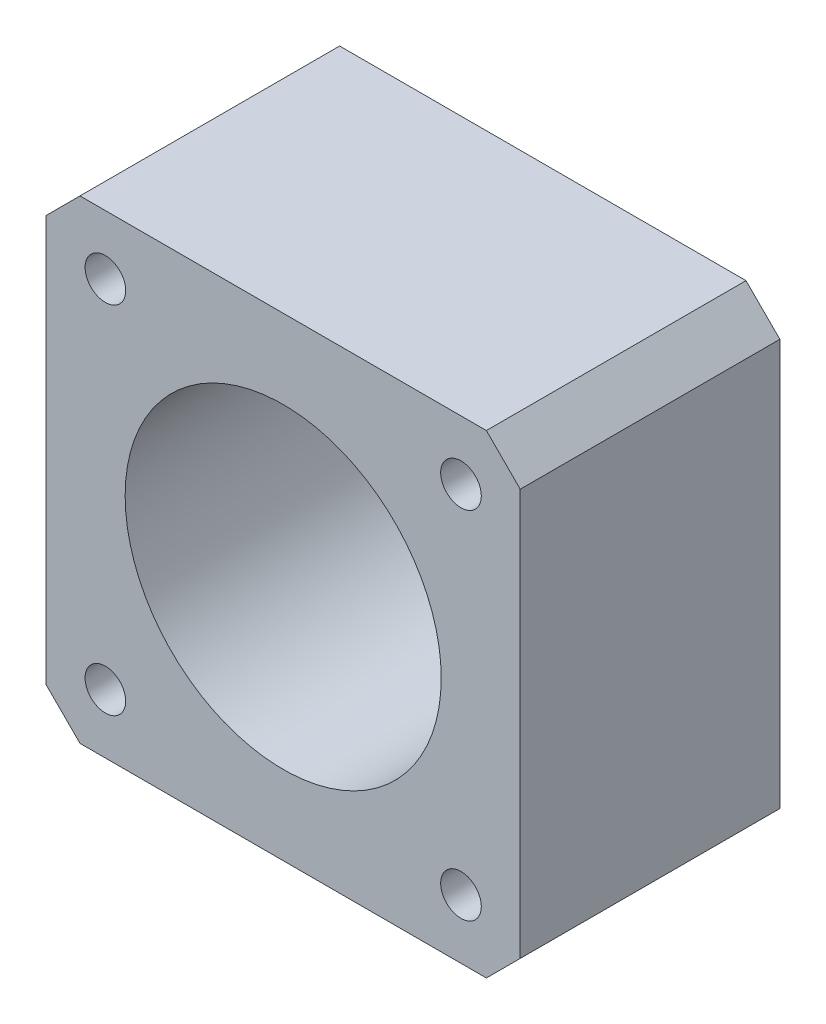
ISO-10303-21;
HEADER;
FILE_DESCRIPTION(('STEP AP214'),'2;1');
FILE_NAME('part.step','',(''),(''),'','','');
FILE_SCHEMA(('AUTOMOTIVE_DESIGN { 1 0 10303 214 1 1 1 1 }'));
ENDSEC;
DATA;
#1=APPLICATION_CONTEXT('core data for automotive mechanical design processes');
#2=APPLICATION_PROTOCOL_DEFINITION('international standard','automotive_design',2000,#1);
#3=PRODUCT_CONTEXT('',#1,'mechanical');
#4=PRODUCT('Part','Part','',(#3));
#5=PRODUCT_RELATED_PRODUCT_CATEGORY('part','',(#4));
#6=PRODUCT_DEFINITION_FORMATION('','',#4);
#7=PRODUCT_DEFINITION_CONTEXT('part definition',#1,'design');
#8=PRODUCT_DEFINITION('design','',#6,#7);
#9=PRODUCT_DEFINITION_SHAPE('','',#8);
#10=(LENGTH_UNIT() NAMED_UNIT(*) SI_UNIT(.MILLI.,.METRE.));
#11=(NAMED_UNIT(*) PLANE_ANGLE_UNIT() SI_UNIT($,.RADIAN.));
#12=(NAMED_UNIT(*) SI_UNIT($,.STERADIAN.) SOLID_ANGLE_UNIT());
#13=UNCERTAINTY_MEASURE_WITH_UNIT(LENGTH_MEASURE(1.E-05),#10,'distance_accuracy_value','');
#14=(GEOMETRIC_REPRESENTATION_CONTEXT(3) GLOBAL_UNCERTAINTY_ASSIGNED_CONTEXT((#13)) GLOBAL_UNIT_ASSIGNED_CONTEXT((#10,
#11,#12)) REPRESENTATION_CONTEXT('',''));
#15=CARTESIAN_POINT('',(0.,0.,0.));
#16=DIRECTION('',(0.,0.,1.));
#17=DIRECTION('',(1.,0.,0.));
#18=AXIS2_PLACEMENT_3D('',#15,#16,#17);
#19=CARTESIAN_POINT('',(21.,21.,23.));
#20=DIRECTION('',(-1.,0.,0.));
#21=DIRECTION('',(0.,-1.,0.));
#22=AXIS2_PLACEMENT_3D('',#19,#20,#21);
#23=PLANE('',#22);
#24=DIRECTION('',(0.,1.,0.));
#25=VECTOR('',#24,1.);
#26=CARTESIAN_POINT('',(21.,21.,23.));
#27=LINE('',#26,#25);
#28=CARTESIAN_POINT('',(21.,-18.,23.));
#29=VERTEX_POINT('',#28);
#30=CARTESIAN_POINT('',(21.,18.,23.));
#31=VERTEX_POINT('',#30);
#32=EDGE_CURVE('E125',#29,#31,#27,.T.);
#33=ORIENTED_EDGE('',*,*,#32,.F.);
#34=DIRECTION('',(0.,0.,-1.));
#35=VECTOR('',#34,1.);
#36=CARTESIAN_POINT('',(21.,-18.,23.));
#37=LINE('',#36,#35);
#38=CARTESIAN_POINT('',(21.,-18.,0.));
#39=VERTEX_POINT('',#38);
#40=EDGE_CURVE('E151',#29,#39,#37,.T.);
#41=ORIENTED_EDGE('',*,*,#40,.T.);
#42=DIRECTION('',(0.,1.,0.));
#43=VECTOR('',#42,1.);
#44=CARTESIAN_POINT('',(21.,21.,0.));
#45=LINE('',#44,#43);
#46=CARTESIAN_POINT('',(21.,18.,0.));
#47=VERTEX_POINT('',#46);
#48=EDGE_CURVE('E157',#39,#47,#45,.T.);
#49=ORIENTED_EDGE('',*,*,#48,.T.);
#50=DIRECTION('',(0.,0.,1.));
#51=VECTOR('',#50,1.);
#52=CARTESIAN_POINT('',(21.,18.,23.));
#53=LINE('',#52,#51);
#54=EDGE_CURVE('E149',#47,#31,#53,.T.);
#55=ORIENTED_EDGE('',*,*,#54,.T.);
#56=EDGE_LOOP('',(#33,#41,#49,#55));
#57=FACE_BOUND('',#56,.T.);
#58=ADVANCED_FACE('F33',(#57),#23,.F.);
#59=CARTESIAN_POINT('',(-21.,21.,23.));
#60=DIRECTION('',(0.,-1.,0.));
#61=DIRECTION('',(0.,0.,-1.));
#62=AXIS2_PLACEMENT_3D('',#59,#60,#61);
#63=PLANE('',#62);
#64=DIRECTION('',(-1.,0.,0.));
#65=VECTOR('',#64,1.);
#66=CARTESIAN_POINT('',(-21.,21.,23.));
#67=LINE('',#66,#65);
#68=CARTESIAN_POINT('',(18.,21.,23.));
#69=VERTEX_POINT('',#68);
#70=CARTESIAN_POINT('',(-18.,21.,23.));
#71=VERTEX_POINT('',#70);
#72=EDGE_CURVE('E128',#69,#71,#67,.T.);
#73=ORIENTED_EDGE('',*,*,#72,.F.);
#74=DIRECTION('',(0.,0.,-1.));
#75=VECTOR('',#74,1.);
#76=CARTESIAN_POINT('',(18.,21.,23.));
#77=LINE('',#76,#75);
#78=CARTESIAN_POINT('',(18.,21.,0.));
#79=VERTEX_POINT('',#78);
#80=EDGE_CURVE('E11',#69,#79,#77,.T.);
#81=ORIENTED_EDGE('',*,*,#80,.T.);
#82=DIRECTION('',(-1.,0.,0.));
#83=VECTOR('',#82,1.);
#84=CARTESIAN_POINT('',(-21.,21.,0.));
#85=LINE('',#84,#83);
#86=CARTESIAN_POINT('',(-18.,21.,0.));
#87=VERTEX_POINT('',#86);
#88=EDGE_CURVE('E130',#79,#87,#85,.T.);
#89=ORIENTED_EDGE('',*,*,#88,.T.);
#90=DIRECTION('',(0.,0.,1.));
#91=VECTOR('',#90,1.);
#92=CARTESIAN_POINT('',(-18.,21.,23.));
#93=LINE('',#92,#91);
#94=EDGE_CURVE('E41',#87,#71,#93,.T.);
#95=ORIENTED_EDGE('',*,*,#94,.T.);
#96=EDGE_LOOP('',(#73,#81,#89,#95));
#97=FACE_BOUND('',#96,.T.);
#98=ADVANCED_FACE('F220',(#97),#63,.F.);
#99=CARTESIAN_POINT('',(-21.,21.,23.));
#100=DIRECTION('',(1.,0.,0.));
#101=DIRECTION('',(0.,1.,0.));
#102=AXIS2_PLACEMENT_3D('',#99,#100,#101);
#103=PLANE('',#102);
#104=DIRECTION('',(0.,-1.,0.));
#105=VECTOR('',#104,1.);
#106=CARTESIAN_POINT('',(-21.,21.,0.));
#107=LINE('',#106,#105);
#108=CARTESIAN_POINT('',(-21.,18.,0.));
#109=VERTEX_POINT('',#108);
#110=CARTESIAN_POINT('',(-21.,-18.,0.));
#111=VERTEX_POINT('',#110);
#112=EDGE_CURVE('E126',#109,#111,#107,.T.);
#113=ORIENTED_EDGE('',*,*,#112,.T.);
#114=DIRECTION('',(0.,0.,1.));
#115=VECTOR('',#114,1.);
#116=CARTESIAN_POINT('',(-21.,-18.,23.));
#117=LINE('',#116,#115);
#118=CARTESIAN_POINT('',(-21.,-18.,23.));
#119=VERTEX_POINT('',#118);
#120=EDGE_CURVE('E104',#111,#119,#117,.T.);
#121=ORIENTED_EDGE('',*,*,#120,.T.);
#122=DIRECTION('',(0.,-1.,0.));
#123=VECTOR('',#122,1.);
#124=CARTESIAN_POINT('',(-21.,21.,23.));
#125=LINE('',#124,#123);
#126=CARTESIAN_POINT('',(-21.,18.,23.));
#127=VERTEX_POINT('',#126);
#128=EDGE_CURVE('E169',#127,#119,#125,.T.);
#129=ORIENTED_EDGE('',*,*,#128,.F.);
#130=DIRECTION('',(0.,0.,-1.));
#131=VECTOR('',#130,1.);
#132=CARTESIAN_POINT('',(-21.,18.,23.));
#133=LINE('',#132,#131);
#134=EDGE_CURVE('E109',#127,#109,#133,.T.);
#135=ORIENTED_EDGE('',*,*,#134,.T.);
#136=EDGE_LOOP('',(#113,#121,#129,#135));
#137=FACE_BOUND('',#136,.T.);
#138=ADVANCED_FACE('F218',(#137),#103,.F.);
#139=CARTESIAN_POINT('',(-21.,-21.,23.));
#140=DIRECTION('',(0.,1.,0.));
#141=DIRECTION('',(0.,0.,1.));
#142=AXIS2_PLACEMENT_3D('',#139,#140,#141);
#143=PLANE('',#142);
#144=DIRECTION('',(1.,0.,0.));
#145=VECTOR('',#144,1.);
#146=CARTESIAN_POINT('',(-21.,-21.,23.));
#147=LINE('',#146,#145);
#148=CARTESIAN_POINT('',(-18.,-21.,23.));
#149=VERTEX_POINT('',#148);
#150=CARTESIAN_POINT('',(18.,-21.,23.));
#151=VERTEX_POINT('',#150);
#152=EDGE_CURVE('E119',#149,#151,#147,.T.);
#153=ORIENTED_EDGE('',*,*,#152,.F.);
#154=DIRECTION('',(0.,0.,-1.));
#155=VECTOR('',#154,1.);
#156=CARTESIAN_POINT('',(-18.,-21.,23.));
#157=LINE('',#156,#155);
#158=CARTESIAN_POINT('',(-18.,-21.,0.));
#159=VERTEX_POINT('',#158);
#160=EDGE_CURVE('E103',#149,#159,#157,.T.);
#161=ORIENTED_EDGE('',*,*,#160,.T.);
#162=DIRECTION('',(1.,0.,0.));
#163=VECTOR('',#162,1.);
#164=CARTESIAN_POINT('',(-21.,-21.,0.));
#165=LINE('',#164,#163);
#166=CARTESIAN_POINT('',(18.,-21.,0.));
#167=VERTEX_POINT('',#166);
#168=EDGE_CURVE('E116',#159,#167,#165,.T.);
#169=ORIENTED_EDGE('',*,*,#168,.T.);
#170=DIRECTION('',(0.,0.,1.));
#171=VECTOR('',#170,1.);
#172=CARTESIAN_POINT('',(18.,-21.,23.));
#173=LINE('',#172,#171);
#174=EDGE_CURVE('E121',#167,#151,#173,.T.);
#175=ORIENTED_EDGE('',*,*,#174,.T.);
#176=EDGE_LOOP('',(#153,#161,#169,#175));
#177=FACE_BOUND('',#176,.T.);
#178=ADVANCED_FACE('F115',(#177),#143,.F.);
#179=CARTESIAN_POINT('',(0.,0.,23.));
#180=DIRECTION('',(0.,0.,1.));
#181=DIRECTION('',(1.,0.,0.));
#182=AXIS2_PLACEMENT_3D('',#179,#180,#181);
#183=PLANE('',#182);
#184=CARTESIAN_POINT('',(0.,0.,23.));
#185=DIRECTION('',(0.,0.,1.));
#186=DIRECTION('',(1.,0.,0.));
#187=AXIS2_PLACEMENT_3D('',#184,#185,#186);
#188=CIRCLE('',#187,14.);
#189=CARTESIAN_POINT('',(14.,0.,23.));
#190=VERTEX_POINT('',#189);
#191=EDGE_CURVE('E196',#190,#190,#188,.T.);
#192=ORIENTED_EDGE('',*,*,#191,.F.);
#193=EDGE_LOOP('',(#192));
#194=FACE_BOUND('',#193,.T.);
#195=CARTESIAN_POINT('',(15.75,15.75,23.));
#196=DIRECTION('',(0.,0.,1.));
#197=DIRECTION('',(1.,0.,0.));
#198=AXIS2_PLACEMENT_3D('',#195,#196,#197);
#199=CIRCLE('',#198,1.8);
#200=CARTESIAN_POINT('',(17.55,15.75,23.));
#201=VERTEX_POINT('',#200);
#202=EDGE_CURVE('E179',#201,#201,#199,.T.);
#203=ORIENTED_EDGE('',*,*,#202,.F.);
#204=EDGE_LOOP('',(#203));
#205=FACE_BOUND('',#204,.T.);
#206=CARTESIAN_POINT('',(-15.75,-15.75,23.));
#207=DIRECTION('',(0.,0.,1.));
#208=DIRECTION('',(1.,0.,0.));
#209=AXIS2_PLACEMENT_3D('',#206,#207,#208);
#210=CIRCLE('',#209,1.8);
#211=CARTESIAN_POINT('',(-13.95,-15.75,23.));
#212=VERTEX_POINT('',#211);
#213=EDGE_CURVE('E180',#212,#212,#210,.T.);
#214=ORIENTED_EDGE('',*,*,#213,.F.);
#215=EDGE_LOOP('',(#214));
#216=FACE_BOUND('',#215,.T.);
#217=CARTESIAN_POINT('',(15.75,-15.75,23.));
#218=DIRECTION('',(0.,0.,1.));
#219=DIRECTION('',(1.,0.,0.));
#220=AXIS2_PLACEMENT_3D('',#217,#218,#219);
#221=CIRCLE('',#220,1.8);
#222=CARTESIAN_POINT('',(17.55,-15.75,23.));
#223=VERTEX_POINT('',#222);
#224=EDGE_CURVE('E190',#223,#223,#221,.T.);
#225=ORIENTED_EDGE('',*,*,#224,.F.);
#226=EDGE_LOOP('',(#225));
#227=FACE_BOUND('',#226,.T.);
#228=CARTESIAN_POINT('',(-15.75,15.75,23.));
#229=DIRECTION('',(0.,0.,1.));
#230=DIRECTION('',(1.,0.,0.));
#231=AXIS2_PLACEMENT_3D('',#228,#229,#230);
#232=CIRCLE('',#231,1.8);
#233=CARTESIAN_POINT('',(-13.95,15.75,23.));
#234=VERTEX_POINT('',#233);
#235=EDGE_CURVE('E165',#234,#234,#232,.T.);
#236=ORIENTED_EDGE('',*,*,#235,.F.);
#237=EDGE_LOOP('',(#236));
#238=FACE_BOUND('',#237,.T.);
#239=ORIENTED_EDGE('',*,*,#128,.T.);
#240=DIRECTION('',(-0.707106781186546,0.707106781186549,0.));
#241=VECTOR('',#240,1.);
#242=CARTESIAN_POINT('',(-19.5,-19.5,23.));
#243=LINE('',#242,#241);
#244=EDGE_CURVE('E147',#119,#149,#243,.F.);
#245=ORIENTED_EDGE('',*,*,#244,.T.);
#246=ORIENTED_EDGE('',*,*,#152,.T.);
#247=DIRECTION('',(-0.707106781186548,-0.707106781186548,0.));
#248=VECTOR('',#247,1.);
#249=CARTESIAN_POINT('',(19.5,-19.5,23.));
#250=LINE('',#249,#248);
#251=EDGE_CURVE('E145',#151,#29,#250,.F.);
#252=ORIENTED_EDGE('',*,*,#251,.T.);
#253=ORIENTED_EDGE('',*,*,#32,.T.);
#254=DIRECTION('',(0.707106781186546,-0.707106781186549,0.));
#255=VECTOR('',#254,1.);
#256=CARTESIAN_POINT('',(19.5,19.5,23.));
#257=LINE('',#256,#255);
#258=EDGE_CURVE('E54',#31,#69,#257,.F.);
#259=ORIENTED_EDGE('',*,*,#258,.T.);
#260=ORIENTED_EDGE('',*,*,#72,.T.);
#261=DIRECTION('',(0.707106781186548,0.707106781186547,0.));
#262=VECTOR('',#261,1.);
#263=CARTESIAN_POINT('',(-19.5,19.5,23.));
#264=LINE('',#263,#262);
#265=EDGE_CURVE('E142',#71,#127,#264,.F.);
#266=ORIENTED_EDGE('',*,*,#265,.T.);
#267=EDGE_LOOP('',(#239,#245,#246,#252,#253,#259,#260,#266));
#268=FACE_BOUND('',#267,.T.);
#269=ADVANCED_FACE('F203',(#194,#205,#216,#227,#238,#268),#183,.T.);
#270=CARTESIAN_POINT('',(0.,0.,0.));
#271=DIRECTION('',(0.,0.,1.));
#272=DIRECTION('',(1.,0.,0.));
#273=AXIS2_PLACEMENT_3D('',#270,#271,#272);
#274=PLANE('',#273);
#275=CARTESIAN_POINT('',(0.,0.,0.));
#276=DIRECTION('',(0.,0.,1.));
#277=DIRECTION('',(1.,0.,0.));
#278=AXIS2_PLACEMENT_3D('',#275,#276,#277);
#279=CIRCLE('',#278,14.);
#280=CARTESIAN_POINT('',(14.,0.,0.));
#281=VERTEX_POINT('',#280);
#282=EDGE_CURVE('E193',#281,#281,#279,.F.);
#283=ORIENTED_EDGE('',*,*,#282,.F.);
#284=EDGE_LOOP('',(#283));
#285=FACE_BOUND('',#284,.T.);
#286=CARTESIAN_POINT('',(15.75,15.75,0.));
#287=DIRECTION('',(0.,0.,1.));
#288=DIRECTION('',(1.,0.,0.));
#289=AXIS2_PLACEMENT_3D('',#286,#287,#288);
#290=CIRCLE('',#289,1.8);
#291=CARTESIAN_POINT('',(17.55,15.75,0.));
#292=VERTEX_POINT('',#291);
#293=EDGE_CURVE('E175',#292,#292,#290,.F.);
#294=ORIENTED_EDGE('',*,*,#293,.F.);
#295=EDGE_LOOP('',(#294));
#296=FACE_BOUND('',#295,.T.);
#297=CARTESIAN_POINT('',(-15.75,-15.75,0.));
#298=DIRECTION('',(0.,0.,1.));
#299=DIRECTION('',(1.,0.,0.));
#300=AXIS2_PLACEMENT_3D('',#297,#298,#299);
#301=CIRCLE('',#300,1.8);
#302=CARTESIAN_POINT('',(-13.95,-15.75,0.));
#303=VERTEX_POINT('',#302);
#304=EDGE_CURVE('E176',#303,#303,#301,.F.);
#305=ORIENTED_EDGE('',*,*,#304,.F.);
#306=EDGE_LOOP('',(#305));
#307=FACE_BOUND('',#306,.T.);
#308=CARTESIAN_POINT('',(15.75,-15.75,0.));
#309=DIRECTION('',(0.,0.,1.));
#310=DIRECTION('',(1.,0.,0.));
#311=AXIS2_PLACEMENT_3D('',#308,#309,#310);
#312=CIRCLE('',#311,1.8);
#313=CARTESIAN_POINT('',(17.55,-15.75,0.));
#314=VERTEX_POINT('',#313);
#315=EDGE_CURVE('E183',#314,#314,#312,.F.);
#316=ORIENTED_EDGE('',*,*,#315,.F.);
#317=EDGE_LOOP('',(#316));
#318=FACE_BOUND('',#317,.T.);
#319=CARTESIAN_POINT('',(-15.75,15.75,0.));
#320=DIRECTION('',(0.,0.,1.));
#321=DIRECTION('',(1.,0.,0.));
#322=AXIS2_PLACEMENT_3D('',#319,#320,#321);
#323=CIRCLE('',#322,1.8);
#324=CARTESIAN_POINT('',(-13.95,15.75,0.));
#325=VERTEX_POINT('',#324);
#326=EDGE_CURVE('E162',#325,#325,#323,.F.);
#327=ORIENTED_EDGE('',*,*,#326,.F.);
#328=EDGE_LOOP('',(#327));
#329=FACE_BOUND('',#328,.T.);
#330=ORIENTED_EDGE('',*,*,#168,.F.);
#331=DIRECTION('',(0.707106781186546,-0.707106781186549,0.));
#332=VECTOR('',#331,1.);
#333=CARTESIAN_POINT('',(-18.,-21.,0.));
#334=LINE('',#333,#332);
#335=EDGE_CURVE('E99',#159,#111,#334,.F.);
#336=ORIENTED_EDGE('',*,*,#335,.T.);
#337=ORIENTED_EDGE('',*,*,#112,.F.);
#338=DIRECTION('',(-0.707106781186548,-0.707106781186547,0.));
#339=VECTOR('',#338,1.);
#340=CARTESIAN_POINT('',(-21.,18.,0.));
#341=LINE('',#340,#339);
#342=EDGE_CURVE('E120',#109,#87,#341,.F.);
#343=ORIENTED_EDGE('',*,*,#342,.T.);
#344=ORIENTED_EDGE('',*,*,#88,.F.);
#345=DIRECTION('',(-0.707106781186546,0.707106781186549,0.));
#346=VECTOR('',#345,1.);
#347=CARTESIAN_POINT('',(18.,21.,0.));
#348=LINE('',#347,#346);
#349=EDGE_CURVE('E136',#79,#47,#348,.F.);
#350=ORIENTED_EDGE('',*,*,#349,.T.);
#351=ORIENTED_EDGE('',*,*,#48,.F.);
#352=DIRECTION('',(0.707106781186548,0.707106781186548,0.));
#353=VECTOR('',#352,1.);
#354=CARTESIAN_POINT('',(21.,-18.,0.));
#355=LINE('',#354,#353);
#356=EDGE_CURVE('E110',#39,#167,#355,.F.);
#357=ORIENTED_EDGE('',*,*,#356,.T.);
#358=EDGE_LOOP('',(#330,#336,#337,#343,#344,#350,#351,#357));
#359=FACE_BOUND('',#358,.T.);
#360=ADVANCED_FACE('F123',(#285,#296,#307,#318,#329,#359),#274,.F.);
#361=CARTESIAN_POINT('',(-18.,-21.,23.));
#362=DIRECTION('',(0.707106781186549,0.707106781186546,0.));
#363=DIRECTION('',(0.,0.,-1.));
#364=AXIS2_PLACEMENT_3D('',#361,#362,#363);
#365=PLANE('',#364);
#366=ORIENTED_EDGE('',*,*,#244,.F.);
#367=ORIENTED_EDGE('',*,*,#120,.F.);
#368=ORIENTED_EDGE('',*,*,#335,.F.);
#369=ORIENTED_EDGE('',*,*,#160,.F.);
#370=EDGE_LOOP('',(#366,#367,#368,#369));
#371=FACE_BOUND('',#370,.T.);
#372=ADVANCED_FACE('F102',(#371),#365,.F.);
#373=CARTESIAN_POINT('',(21.,-18.,23.));
#374=DIRECTION('',(-0.707106781186548,0.707106781186548,0.));
#375=DIRECTION('',(0.,0.,-1.));
#376=AXIS2_PLACEMENT_3D('',#373,#374,#375);
#377=PLANE('',#376);
#378=ORIENTED_EDGE('',*,*,#251,.F.);
#379=ORIENTED_EDGE('',*,*,#174,.F.);
#380=ORIENTED_EDGE('',*,*,#356,.F.);
#381=ORIENTED_EDGE('',*,*,#40,.F.);
#382=EDGE_LOOP('',(#378,#379,#380,#381));
#383=FACE_BOUND('',#382,.T.);
#384=ADVANCED_FACE('F224',(#383),#377,.F.);
#385=CARTESIAN_POINT('',(18.,21.,23.));
#386=DIRECTION('',(-0.707106781186549,-0.707106781186546,0.));
#387=DIRECTION('',(0.,0.,-1.));
#388=AXIS2_PLACEMENT_3D('',#385,#386,#387);
#389=PLANE('',#388);
#390=ORIENTED_EDGE('',*,*,#258,.F.);
#391=ORIENTED_EDGE('',*,*,#54,.F.);
#392=ORIENTED_EDGE('',*,*,#349,.F.);
#393=ORIENTED_EDGE('',*,*,#80,.F.);
#394=EDGE_LOOP('',(#390,#391,#392,#393));
#395=FACE_BOUND('',#394,.T.);
#396=ADVANCED_FACE('F223',(#395),#389,.F.);
#397=CARTESIAN_POINT('',(-21.,18.,23.));
#398=DIRECTION('',(0.707106781186547,-0.707106781186548,0.));
#399=DIRECTION('',(0.,0.,-1.));
#400=AXIS2_PLACEMENT_3D('',#397,#398,#399);
#401=PLANE('',#400);
#402=ORIENTED_EDGE('',*,*,#265,.F.);
#403=ORIENTED_EDGE('',*,*,#94,.F.);
#404=ORIENTED_EDGE('',*,*,#342,.F.);
#405=ORIENTED_EDGE('',*,*,#134,.F.);
#406=EDGE_LOOP('',(#402,#403,#404,#405));
#407=FACE_BOUND('',#406,.T.);
#408=ADVANCED_FACE('F35',(#407),#401,.F.);
#409=CARTESIAN_POINT('',(-15.75,15.75,-0.001000000000001));
#410=DIRECTION('',(0.,0.,1.));
#411=DIRECTION('',(1.,0.,0.));
#412=AXIS2_PLACEMENT_3D('',#409,#410,#411);
#413=CYLINDRICAL_SURFACE('',#412,1.8);
#414=ORIENTED_EDGE('',*,*,#235,.T.);
#415=EDGE_LOOP('',(#414));
#416=FACE_BOUND('',#415,.T.);
#417=ORIENTED_EDGE('',*,*,#326,.T.);
#418=EDGE_LOOP('',(#417));
#419=FACE_BOUND('',#418,.T.);
#420=ADVANCED_FACE('F246',(#416,#419),#413,.F.);
#421=CARTESIAN_POINT('',(15.75,-15.75,-0.001000000000001));
#422=DIRECTION('',(0.,0.,1.));
#423=DIRECTION('',(1.,0.,0.));
#424=AXIS2_PLACEMENT_3D('',#421,#422,#423);
#425=CYLINDRICAL_SURFACE('',#424,1.8);
#426=ORIENTED_EDGE('',*,*,#224,.T.);
#427=EDGE_LOOP('',(#426));
#428=FACE_BOUND('',#427,.T.);
#429=ORIENTED_EDGE('',*,*,#315,.T.);
#430=EDGE_LOOP('',(#429));
#431=FACE_BOUND('',#430,.T.);
#432=ADVANCED_FACE('F249',(#428,#431),#425,.F.);
#433=CARTESIAN_POINT('',(-15.75,-15.75,-0.001000000000001));
#434=DIRECTION('',(0.,0.,1.));
#435=DIRECTION('',(1.,0.,0.));
#436=AXIS2_PLACEMENT_3D('',#433,#434,#435);
#437=CYLINDRICAL_SURFACE('',#436,1.8);
#438=ORIENTED_EDGE('',*,*,#213,.T.);
#439=EDGE_LOOP('',(#438));
#440=FACE_BOUND('',#439,.T.);
#441=ORIENTED_EDGE('',*,*,#304,.T.);
#442=EDGE_LOOP('',(#441));
#443=FACE_BOUND('',#442,.T.);
#444=ADVANCED_FACE('F251',(#440,#443),#437,.F.);
#445=CARTESIAN_POINT('',(15.75,15.75,-0.001000000000001));
#446=DIRECTION('',(0.,0.,1.));
#447=DIRECTION('',(1.,0.,0.));
#448=AXIS2_PLACEMENT_3D('',#445,#446,#447);
#449=CYLINDRICAL_SURFACE('',#448,1.8);
#450=ORIENTED_EDGE('',*,*,#202,.T.);
#451=EDGE_LOOP('',(#450));
#452=FACE_BOUND('',#451,.T.);
#453=ORIENTED_EDGE('',*,*,#293,.T.);
#454=EDGE_LOOP('',(#453));
#455=FACE_BOUND('',#454,.T.);
#456=ADVANCED_FACE('F254',(#452,#455),#449,.F.);
#457=CARTESIAN_POINT('',(0.,0.,-0.001000000000001));
#458=DIRECTION('',(0.,0.,1.));
#459=DIRECTION('',(1.,0.,0.));
#460=AXIS2_PLACEMENT_3D('',#457,#458,#459);
#461=CYLINDRICAL_SURFACE('',#460,14.);
#462=ORIENTED_EDGE('',*,*,#191,.T.);
#463=EDGE_LOOP('',(#462));
#464=FACE_BOUND('',#463,.T.);
#465=ORIENTED_EDGE('',*,*,#282,.T.);
#466=EDGE_LOOP('',(#465));
#467=FACE_BOUND('',#466,.T.);
#468=ADVANCED_FACE('F200',(#464,#467),#461,.F.);
#469=CLOSED_SHELL('',(#58,#98,#138,#178,#269,#360,#372,#384,#396,#408,#420,#432,#444,#456,#468));
#470=MANIFOLD_SOLID_BREP('B2',#469);
#471=ADVANCED_BREP_SHAPE_REPRESENTATION('',(#18,#470),#14);
#472=SHAPE_DEFINITION_REPRESENTATION(#9,#471);
ENDSEC;
END-ISO-10303-21;
